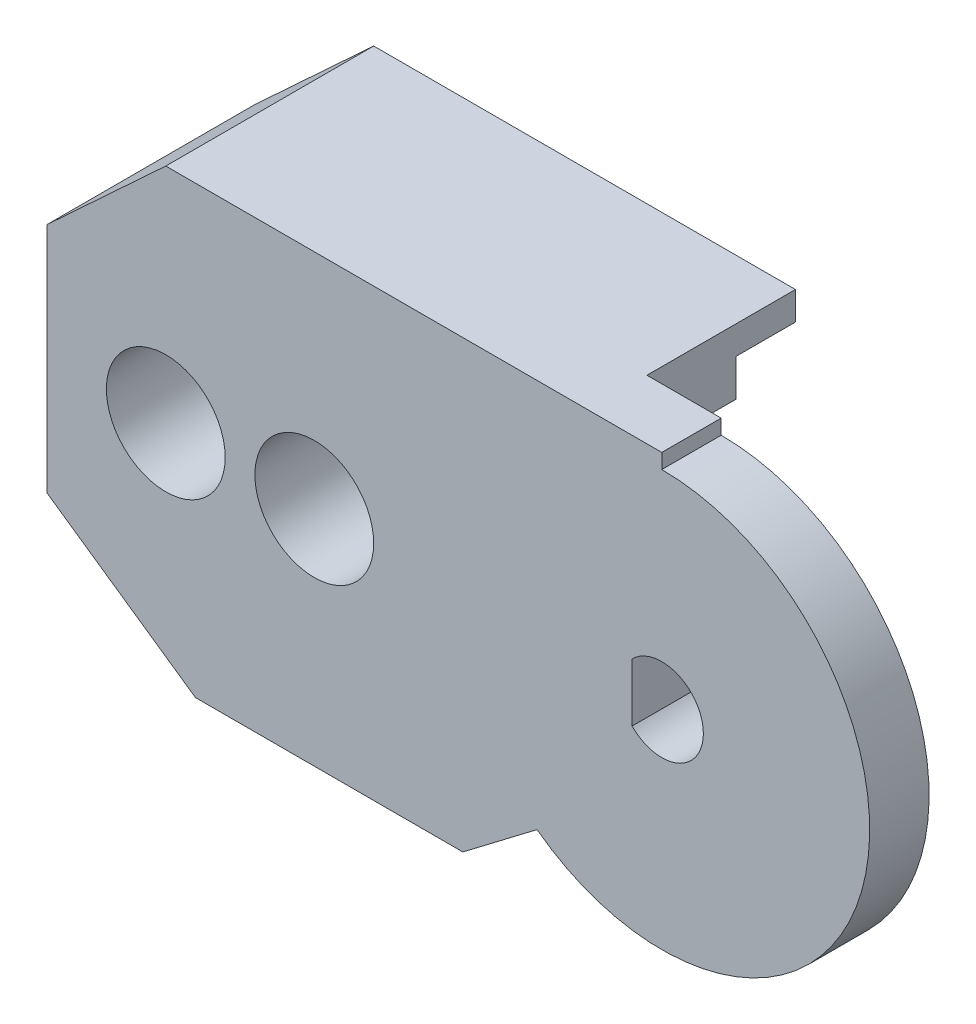
ISO-10303-21;
HEADER;
FILE_DESCRIPTION(('STEP AP214'),'2;1');
FILE_NAME('part.step','',(''),(''),'','','');
FILE_SCHEMA(('AUTOMOTIVE_DESIGN { 1 0 10303 214 1 1 1 1 }'));
ENDSEC;
DATA;
#1=APPLICATION_CONTEXT('core data for automotive mechanical design processes');
#2=APPLICATION_PROTOCOL_DEFINITION('international standard','automotive_design',2000,#1);
#3=PRODUCT_CONTEXT('',#1,'mechanical');
#4=PRODUCT('Part','Part','',(#3));
#5=PRODUCT_RELATED_PRODUCT_CATEGORY('part','',(#4));
#6=PRODUCT_DEFINITION_FORMATION('','',#4);
#7=PRODUCT_DEFINITION_CONTEXT('part definition',#1,'design');
#8=PRODUCT_DEFINITION('design','',#6,#7);
#9=PRODUCT_DEFINITION_SHAPE('','',#8);
#10=(LENGTH_UNIT() NAMED_UNIT(*) SI_UNIT(.MILLI.,.METRE.));
#11=(NAMED_UNIT(*) PLANE_ANGLE_UNIT() SI_UNIT($,.RADIAN.));
#12=(NAMED_UNIT(*) SI_UNIT($,.STERADIAN.) SOLID_ANGLE_UNIT());
#13=UNCERTAINTY_MEASURE_WITH_UNIT(LENGTH_MEASURE(1.E-05),#10,'distance_accuracy_value','');
#14=(GEOMETRIC_REPRESENTATION_CONTEXT(3) GLOBAL_UNCERTAINTY_ASSIGNED_CONTEXT((#13)) GLOBAL_UNIT_ASSIGNED_CONTEXT((#10,
#11,#12)) REPRESENTATION_CONTEXT('',''));
#15=CARTESIAN_POINT('',(0.,0.,0.));
#16=DIRECTION('',(0.,0.,1.));
#17=DIRECTION('',(1.,0.,0.));
#18=AXIS2_PLACEMENT_3D('',#15,#16,#17);
#19=CARTESIAN_POINT('',(-11.7,0.,3.));
#20=DIRECTION('',(0.,0.,-1.));
#21=DIRECTION('',(-1.,0.,0.));
#22=AXIS2_PLACEMENT_3D('',#19,#20,#21);
#23=CYLINDRICAL_SURFACE('',#22,0.949999999999999);
#24=CARTESIAN_POINT('',(-11.7,0.,-5.));
#25=DIRECTION('',(0.,0.,-1.));
#26=DIRECTION('',(-1.,0.,0.));
#27=AXIS2_PLACEMENT_3D('',#24,#25,#26);
#28=CIRCLE('',#27,0.949999999999999);
#29=CARTESIAN_POINT('',(-12.65,0.,-5.));
#30=VERTEX_POINT('',#29);
#31=EDGE_CURVE('E294',#30,#30,#28,.T.);
#32=ORIENTED_EDGE('',*,*,#31,.T.);
#33=EDGE_LOOP('',(#32));
#34=FACE_BOUND('',#33,.T.);
#35=CARTESIAN_POINT('',(-11.7,0.,-1.));
#36=DIRECTION('',(0.,0.,1.));
#37=DIRECTION('',(1.,0.,0.));
#38=AXIS2_PLACEMENT_3D('',#35,#36,#37);
#39=CIRCLE('',#38,0.949999999999999);
#40=CARTESIAN_POINT('',(-10.75,0.,-1.));
#41=VERTEX_POINT('',#40);
#42=EDGE_CURVE('E38',#41,#41,#39,.F.);
#43=ORIENTED_EDGE('',*,*,#42,.F.);
#44=EDGE_LOOP('',(#43));
#45=FACE_BOUND('',#44,.T.);
#46=ADVANCED_FACE('F34',(#34,#45),#23,.F.);
#47=CARTESIAN_POINT('',(-16.7,0.,3.));
#48=DIRECTION('',(0.,0.,-1.));
#49=DIRECTION('',(-1.,0.,0.));
#50=AXIS2_PLACEMENT_3D('',#47,#48,#49);
#51=CYLINDRICAL_SURFACE('',#50,0.950000000000001);
#52=CARTESIAN_POINT('',(-16.7,0.,-5.));
#53=DIRECTION('',(0.,0.,-1.));
#54=DIRECTION('',(-1.,0.,0.));
#55=AXIS2_PLACEMENT_3D('',#52,#53,#54);
#56=CIRCLE('',#55,0.950000000000001);
#57=CARTESIAN_POINT('',(-17.65,0.,-5.));
#58=VERTEX_POINT('',#57);
#59=EDGE_CURVE('E313',#58,#58,#56,.T.);
#60=ORIENTED_EDGE('',*,*,#59,.T.);
#61=EDGE_LOOP('',(#60));
#62=FACE_BOUND('',#61,.T.);
#63=CARTESIAN_POINT('',(-16.7,0.,-1.));
#64=DIRECTION('',(0.,0.,1.));
#65=DIRECTION('',(1.,0.,0.));
#66=AXIS2_PLACEMENT_3D('',#63,#64,#65);
#67=CIRCLE('',#66,0.950000000000001);
#68=CARTESIAN_POINT('',(-15.75,0.,-1.));
#69=VERTEX_POINT('',#68);
#70=EDGE_CURVE('E288',#69,#69,#67,.F.);
#71=ORIENTED_EDGE('',*,*,#70,.F.);
#72=EDGE_LOOP('',(#71));
#73=FACE_BOUND('',#72,.T.);
#74=ADVANCED_FACE('F455',(#62,#73),#51,.F.);
#75=CARTESIAN_POINT('',(0.,0.,-5.));
#76=DIRECTION('',(0.,0.,-1.));
#77=DIRECTION('',(-1.,0.,0.));
#78=AXIS2_PLACEMENT_3D('',#75,#76,#77);
#79=PLANE('',#78);
#80=DIRECTION('',(-0.422651733732796,-0.90629217803789,0.));
#81=VECTOR('',#80,1.);
#82=CARTESIAN_POINT('',(-4.05473958622524,1.89093843848827,-5.));
#83=LINE('',#82,#81);
#84=CARTESIAN_POINT('',(-7.03517048551268,-4.5,-5.));
#85=VERTEX_POINT('',#84);
#86=CARTESIAN_POINT('',(-8.43422835219701,-7.5,-5.));
#87=VERTEX_POINT('',#86);
#88=EDGE_CURVE('E43',#85,#87,#83,.T.);
#89=ORIENTED_EDGE('',*,*,#88,.F.);
#90=DIRECTION('',(1.,0.,0.));
#91=VECTOR('',#90,1.);
#92=CARTESIAN_POINT('',(-7.7,-4.5,-5.));
#93=LINE('',#92,#91);
#94=CARTESIAN_POINT('',(-6.69999999999999,-4.5,-5.));
#95=VERTEX_POINT('',#94);
#96=EDGE_CURVE('E370',#85,#95,#93,.T.);
#97=ORIENTED_EDGE('',*,*,#96,.T.);
#98=DIRECTION('',(0.,-1.,0.));
#99=VECTOR('',#98,1.);
#100=CARTESIAN_POINT('',(-6.69999999999999,-7.5,-5.));
#101=LINE('',#100,#99);
#102=CARTESIAN_POINT('',(-6.69999999999999,-7.5,-5.));
#103=VERTEX_POINT('',#102);
#104=EDGE_CURVE('E372',#95,#103,#101,.T.);
#105=ORIENTED_EDGE('',*,*,#104,.T.);
#106=DIRECTION('',(-1.,0.,0.));
#107=VECTOR('',#106,1.);
#108=CARTESIAN_POINT('',(-15.7,-7.5,-5.));
#109=LINE('',#108,#107);
#110=EDGE_CURVE('E375',#103,#87,#109,.T.);
#111=ORIENTED_EDGE('',*,*,#110,.T.);
#112=EDGE_LOOP('',(#89,#97,#105,#111));
#113=FACE_BOUND('',#112,.T.);
#114=ADVANCED_FACE('F461',(#113),#79,.T.);
#115=CARTESIAN_POINT('',(0.,0.,0.));
#116=DIRECTION('',(0.,0.,1.));
#117=DIRECTION('',(1.,0.,0.));
#118=AXIS2_PLACEMENT_3D('',#115,#116,#117);
#119=PLANE('',#118);
#120=CARTESIAN_POINT('',(0.,0.,0.));
#121=DIRECTION('',(0.,0.,1.));
#122=DIRECTION('',(1.,0.,0.));
#123=AXIS2_PLACEMENT_3D('',#120,#121,#122);
#124=CIRCLE('',#123,3.9);
#125=CARTESIAN_POINT('',(3.9,0.,0.));
#126=VERTEX_POINT('',#125);
#127=EDGE_CURVE('E280',#126,#126,#124,.F.);
#128=ORIENTED_EDGE('',*,*,#127,.F.);
#129=EDGE_LOOP('',(#128));
#130=FACE_BOUND('',#129,.T.);
#131=DIRECTION('',(0.,-1.,0.));
#132=VECTOR('',#131,1.);
#133=CARTESIAN_POINT('',(-6.69999999999999,-7.5,0.));
#134=LINE('',#133,#132);
#135=CARTESIAN_POINT('',(-6.69999999999999,-4.5,0.));
#136=VERTEX_POINT('',#135);
#137=CARTESIAN_POINT('',(-6.69999999999999,-7.5,0.));
#138=VERTEX_POINT('',#137);
#139=EDGE_CURVE('E360',#136,#138,#134,.T.);
#140=ORIENTED_EDGE('',*,*,#139,.F.);
#141=DIRECTION('',(1.,0.,0.));
#142=VECTOR('',#141,1.);
#143=CARTESIAN_POINT('',(-7.7,-4.5,0.));
#144=LINE('',#143,#142);
#145=CARTESIAN_POINT('',(-7.7,-4.5,0.));
#146=VERTEX_POINT('',#145);
#147=EDGE_CURVE('E400',#146,#136,#144,.T.);
#148=ORIENTED_EDGE('',*,*,#147,.F.);
#149=DIRECTION('',(0.,-1.,0.));
#150=VECTOR('',#149,1.);
#151=CARTESIAN_POINT('',(-7.7,2.,0.));
#152=LINE('',#151,#150);
#153=CARTESIAN_POINT('',(-7.7,2.,0.));
#154=VERTEX_POINT('',#153);
#155=EDGE_CURVE('E397',#154,#146,#152,.T.);
#156=ORIENTED_EDGE('',*,*,#155,.F.);
#157=DIRECTION('',(-1.,0.,0.));
#158=VECTOR('',#157,1.);
#159=CARTESIAN_POINT('',(-5.5,2.,0.));
#160=LINE('',#159,#158);
#161=CARTESIAN_POINT('',(-5.5,2.,0.));
#162=VERTEX_POINT('',#161);
#163=EDGE_CURVE('E394',#162,#154,#160,.T.);
#164=ORIENTED_EDGE('',*,*,#163,.F.);
#165=DIRECTION('',(0.,-1.,0.));
#166=VECTOR('',#165,1.);
#167=CARTESIAN_POINT('',(-5.5,5.3,0.));
#168=LINE('',#167,#166);
#169=CARTESIAN_POINT('',(-5.5,5.3,0.));
#170=VERTEX_POINT('',#169);
#171=EDGE_CURVE('E391',#170,#162,#168,.T.);
#172=ORIENTED_EDGE('',*,*,#171,.F.);
#173=DIRECTION('',(-1.,0.,0.));
#174=VECTOR('',#173,1.);
#175=CARTESIAN_POINT('',(-2.5,5.3,0.));
#176=LINE('',#175,#174);
#177=CARTESIAN_POINT('',(-2.5,5.3,0.));
#178=VERTEX_POINT('',#177);
#179=EDGE_CURVE('E389',#178,#170,#176,.T.);
#180=ORIENTED_EDGE('',*,*,#179,.F.);
#181=DIRECTION('',(0.,-1.,0.));
#182=VECTOR('',#181,1.);
#183=CARTESIAN_POINT('',(-2.5,7.5,0.));
#184=LINE('',#183,#182);
#185=CARTESIAN_POINT('',(-2.5,7.5,0.));
#186=VERTEX_POINT('',#185);
#187=EDGE_CURVE('E225',#186,#178,#184,.T.);
#188=ORIENTED_EDGE('',*,*,#187,.F.);
#189=DIRECTION('',(-1.,0.,0.));
#190=VECTOR('',#189,1.);
#191=CARTESIAN_POINT('',(0.,7.5,0.));
#192=LINE('',#191,#190);
#193=CARTESIAN_POINT('',(0.,7.5,0.));
#194=VERTEX_POINT('',#193);
#195=EDGE_CURVE('E255',#194,#186,#192,.T.);
#196=ORIENTED_EDGE('',*,*,#195,.F.);
#197=DIRECTION('',(0.,1.,0.));
#198=VECTOR('',#197,1.);
#199=CARTESIAN_POINT('',(0.,7.,0.));
#200=LINE('',#199,#198);
#201=CARTESIAN_POINT('',(0.,7.,0.));
#202=VERTEX_POINT('',#201);
#203=EDGE_CURVE('E228',#202,#194,#200,.T.);
#204=ORIENTED_EDGE('',*,*,#203,.F.);
#205=CARTESIAN_POINT('',(0.,0.,0.));
#206=DIRECTION('',(0.,0.,1.));
#207=DIRECTION('',(1.,0.,0.));
#208=AXIS2_PLACEMENT_3D('',#205,#206,#207);
#209=CIRCLE('',#208,7.);
#210=CARTESIAN_POINT('',(-4.19999999999999,-5.6,0.));
#211=VERTEX_POINT('',#210);
#212=EDGE_CURVE('E238',#211,#202,#209,.T.);
#213=ORIENTED_EDGE('',*,*,#212,.F.);
#214=DIRECTION('',(0.796162194123103,0.605083267533557,0.));
#215=VECTOR('',#214,1.);
#216=CARTESIAN_POINT('',(-6.69999999999999,-7.5,0.));
#217=LINE('',#216,#215);
#218=EDGE_CURVE('E258',#138,#211,#217,.T.);
#219=ORIENTED_EDGE('',*,*,#218,.F.);
#220=EDGE_LOOP('',(#140,#148,#156,#164,#172,#180,#188,#196,#204,#213,#219));
#221=FACE_BOUND('',#220,.T.);
#222=ADVANCED_FACE('F425',(#130,#221),#119,.F.);
#223=CARTESIAN_POINT('',(0.,7.,2.));
#224=DIRECTION('',(-1.,0.,0.));
#225=DIRECTION('',(0.,0.,1.));
#226=AXIS2_PLACEMENT_3D('',#223,#224,#225);
#227=PLANE('',#226);
#228=ORIENTED_EDGE('',*,*,#203,.T.);
#229=DIRECTION('',(0.,0.,-1.));
#230=VECTOR('',#229,1.);
#231=CARTESIAN_POINT('',(0.,7.5,2.));
#232=LINE('',#231,#230);
#233=CARTESIAN_POINT('',(0.,7.5,2.));
#234=VERTEX_POINT('',#233);
#235=EDGE_CURVE('E274',#234,#194,#232,.T.);
#236=ORIENTED_EDGE('',*,*,#235,.F.);
#237=DIRECTION('',(0.,1.,0.));
#238=VECTOR('',#237,1.);
#239=CARTESIAN_POINT('',(0.,7.,2.));
#240=LINE('',#239,#238);
#241=CARTESIAN_POINT('',(0.,7.,2.));
#242=VERTEX_POINT('',#241);
#243=EDGE_CURVE('E237',#242,#234,#240,.T.);
#244=ORIENTED_EDGE('',*,*,#243,.F.);
#245=DIRECTION('',(0.,0.,-1.));
#246=VECTOR('',#245,1.);
#247=CARTESIAN_POINT('',(0.,7.,2.));
#248=LINE('',#247,#246);
#249=EDGE_CURVE('E277',#242,#202,#248,.T.);
#250=ORIENTED_EDGE('',*,*,#249,.T.);
#251=EDGE_LOOP('',(#228,#236,#244,#250));
#252=FACE_BOUND('',#251,.T.);
#253=ADVANCED_FACE('F36',(#252),#227,.F.);
#254=CARTESIAN_POINT('',(0.,7.5,2.));
#255=DIRECTION('',(0.,-1.,0.));
#256=DIRECTION('',(0.,0.,-1.));
#257=AXIS2_PLACEMENT_3D('',#254,#255,#256);
#258=PLANE('',#257);
#259=ORIENTED_EDGE('',*,*,#195,.T.);
#260=DIRECTION('',(0.,0.,1.));
#261=VECTOR('',#260,1.);
#262=CARTESIAN_POINT('',(-2.5,7.5,-5.));
#263=LINE('',#262,#261);
#264=CARTESIAN_POINT('',(-2.5,7.5,-5.));
#265=VERTEX_POINT('',#264);
#266=EDGE_CURVE('E226',#265,#186,#263,.T.);
#267=ORIENTED_EDGE('',*,*,#266,.F.);
#268=DIRECTION('',(1.,0.,0.));
#269=VECTOR('',#268,1.);
#270=CARTESIAN_POINT('',(-16.7,7.5,-5.));
#271=LINE('',#270,#269);
#272=CARTESIAN_POINT('',(-16.7,7.5,-5.));
#273=VERTEX_POINT('',#272);
#274=EDGE_CURVE('E356',#273,#265,#271,.T.);
#275=ORIENTED_EDGE('',*,*,#274,.F.);
#276=DIRECTION('',(0.,0.,-1.));
#277=VECTOR('',#276,1.);
#278=CARTESIAN_POINT('',(-16.7,7.5,2.));
#279=LINE('',#278,#277);
#280=CARTESIAN_POINT('',(-16.7,7.5,2.));
#281=VERTEX_POINT('',#280);
#282=EDGE_CURVE('E272',#281,#273,#279,.T.);
#283=ORIENTED_EDGE('',*,*,#282,.F.);
#284=DIRECTION('',(-1.,0.,0.));
#285=VECTOR('',#284,1.);
#286=CARTESIAN_POINT('',(0.,7.5,2.));
#287=LINE('',#286,#285);
#288=EDGE_CURVE('E240',#234,#281,#287,.T.);
#289=ORIENTED_EDGE('',*,*,#288,.F.);
#290=ORIENTED_EDGE('',*,*,#235,.T.);
#291=EDGE_LOOP('',(#259,#267,#275,#283,#289,#290));
#292=FACE_BOUND('',#291,.T.);
#293=ADVANCED_FACE('F546',(#292),#258,.F.);
#294=CARTESIAN_POINT('',(-20.7,3.79344266559656,2.));
#295=DIRECTION('',(0.679689720184301,-0.733499750699198,0.));
#296=DIRECTION('',(0.733499750699198,0.679689720184301,0.));
#297=AXIS2_PLACEMENT_3D('',#294,#295,#296);
#298=PLANE('',#297);
#299=ORIENTED_EDGE('',*,*,#282,.T.);
#300=DIRECTION('',(0.733499750699198,0.679689720184301,0.));
#301=VECTOR('',#300,1.);
#302=CARTESIAN_POINT('',(-16.7,7.5,-5.));
#303=LINE('',#302,#301);
#304=CARTESIAN_POINT('',(-20.7,3.79344266559656,-5.));
#305=VERTEX_POINT('',#304);
#306=EDGE_CURVE('E384',#305,#273,#303,.T.);
#307=ORIENTED_EDGE('',*,*,#306,.F.);
#308=DIRECTION('',(0.,0.,-1.));
#309=VECTOR('',#308,1.);
#310=CARTESIAN_POINT('',(-20.7,3.79344266559656,2.));
#311=LINE('',#310,#309);
#312=CARTESIAN_POINT('',(-20.7,3.79344266559656,2.));
#313=VERTEX_POINT('',#312);
#314=EDGE_CURVE('E270',#313,#305,#311,.T.);
#315=ORIENTED_EDGE('',*,*,#314,.F.);
#316=DIRECTION('',(-0.733499750699198,-0.679689720184301,0.));
#317=VECTOR('',#316,1.);
#318=CARTESIAN_POINT('',(-20.7,3.79344266559656,2.));
#319=LINE('',#318,#317);
#320=EDGE_CURVE('E242',#281,#313,#319,.T.);
#321=ORIENTED_EDGE('',*,*,#320,.F.);
#322=EDGE_LOOP('',(#299,#307,#315,#321));
#323=FACE_BOUND('',#322,.T.);
#324=ADVANCED_FACE('F543',(#323),#298,.F.);
#325=CARTESIAN_POINT('',(-20.7,3.79344266559656,2.));
#326=DIRECTION('',(1.,0.,0.));
#327=DIRECTION('',(0.,1.,0.));
#328=AXIS2_PLACEMENT_3D('',#325,#326,#327);
#329=PLANE('',#328);
#330=ORIENTED_EDGE('',*,*,#314,.T.);
#331=DIRECTION('',(0.,1.,0.));
#332=VECTOR('',#331,1.);
#333=CARTESIAN_POINT('',(-20.7,3.79344266559656,-5.));
#334=LINE('',#333,#332);
#335=CARTESIAN_POINT('',(-20.7,-4.03164877833717,-5.));
#336=VERTEX_POINT('',#335);
#337=EDGE_CURVE('E381',#336,#305,#334,.T.);
#338=ORIENTED_EDGE('',*,*,#337,.F.);
#339=DIRECTION('',(0.,0.,-1.));
#340=VECTOR('',#339,1.);
#341=CARTESIAN_POINT('',(-20.7,-4.03164877833717,2.));
#342=LINE('',#341,#340);
#343=CARTESIAN_POINT('',(-20.7,-4.03164877833717,2.));
#344=VERTEX_POINT('',#343);
#345=EDGE_CURVE('E268',#344,#336,#342,.T.);
#346=ORIENTED_EDGE('',*,*,#345,.F.);
#347=DIRECTION('',(0.,-1.,0.));
#348=VECTOR('',#347,1.);
#349=CARTESIAN_POINT('',(-20.7,3.79344266559656,2.));
#350=LINE('',#349,#348);
#351=EDGE_CURVE('E244',#313,#344,#350,.T.);
#352=ORIENTED_EDGE('',*,*,#351,.F.);
#353=EDGE_LOOP('',(#330,#338,#346,#352));
#354=FACE_BOUND('',#353,.T.);
#355=ADVANCED_FACE('F539',(#354),#329,.F.);
#356=CARTESIAN_POINT('',(-20.7,-4.03164877833717,2.));
#357=DIRECTION('',(0.569966563784045,0.821667886781642,0.));
#358=DIRECTION('',(-0.821667886781642,0.569966563784045,0.));
#359=AXIS2_PLACEMENT_3D('',#356,#357,#358);
#360=PLANE('',#359);
#361=ORIENTED_EDGE('',*,*,#345,.T.);
#362=DIRECTION('',(-0.821667886781642,0.569966563784045,0.));
#363=VECTOR('',#362,1.);
#364=CARTESIAN_POINT('',(-20.7,-4.03164877833717,-5.));
#365=LINE('',#364,#363);
#366=CARTESIAN_POINT('',(-15.7,-7.5,-5.));
#367=VERTEX_POINT('',#366);
#368=EDGE_CURVE('E378',#367,#336,#365,.T.);
#369=ORIENTED_EDGE('',*,*,#368,.F.);
#370=DIRECTION('',(0.,0.,-1.));
#371=VECTOR('',#370,1.);
#372=CARTESIAN_POINT('',(-15.7,-7.5,2.));
#373=LINE('',#372,#371);
#374=CARTESIAN_POINT('',(-15.7,-7.5,2.));
#375=VERTEX_POINT('',#374);
#376=EDGE_CURVE('E265',#375,#367,#373,.T.);
#377=ORIENTED_EDGE('',*,*,#376,.F.);
#378=DIRECTION('',(0.821667886781642,-0.569966563784045,0.));
#379=VECTOR('',#378,1.);
#380=CARTESIAN_POINT('',(-20.7,-4.03164877833717,2.));
#381=LINE('',#380,#379);
#382=EDGE_CURVE('E246',#344,#375,#381,.T.);
#383=ORIENTED_EDGE('',*,*,#382,.F.);
#384=EDGE_LOOP('',(#361,#369,#377,#383));
#385=FACE_BOUND('',#384,.T.);
#386=ADVANCED_FACE('F535',(#385),#360,.F.);
#387=CARTESIAN_POINT('',(-15.7,-7.5,2.));
#388=DIRECTION('',(0.,1.,0.));
#389=DIRECTION('',(-1.,0.,0.));
#390=AXIS2_PLACEMENT_3D('',#387,#388,#389);
#391=PLANE('',#390);
#392=CARTESIAN_POINT('',(-9.93422835219701,-7.5,-5.));
#393=VERTEX_POINT('',#392);
#394=EDGE_CURVE('E374',#393,#367,#109,.T.);
#395=ORIENTED_EDGE('',*,*,#394,.F.);
#396=DIRECTION('',(0.,0.,-1.));
#397=VECTOR('',#396,1.);
#398=CARTESIAN_POINT('',(-9.93422835219701,-7.5,-5.75));
#399=LINE('',#398,#397);
#400=CARTESIAN_POINT('',(-9.93422835219701,-7.5,-4.25));
#401=VERTEX_POINT('',#400);
#402=EDGE_CURVE('E316',#401,#393,#399,.T.);
#403=ORIENTED_EDGE('',*,*,#402,.F.);
#404=DIRECTION('',(-1.,0.,0.));
#405=VECTOR('',#404,1.);
#406=CARTESIAN_POINT('',(-8.43422835219701,-7.5,-4.25));
#407=LINE('',#406,#405);
#408=CARTESIAN_POINT('',(-8.43422835219701,-7.5,-4.25));
#409=VERTEX_POINT('',#408);
#410=EDGE_CURVE('E321',#409,#401,#407,.T.);
#411=ORIENTED_EDGE('',*,*,#410,.F.);
#412=DIRECTION('',(0.,0.,1.));
#413=VECTOR('',#412,1.);
#414=CARTESIAN_POINT('',(-8.43422835219701,-7.5,-5.75));
#415=LINE('',#414,#413);
#416=EDGE_CURVE('E325',#87,#409,#415,.T.);
#417=ORIENTED_EDGE('',*,*,#416,.F.);
#418=ORIENTED_EDGE('',*,*,#110,.F.);
#419=DIRECTION('',(0.,0.,1.));
#420=VECTOR('',#419,1.);
#421=CARTESIAN_POINT('',(-6.69999999999999,-7.5,-5.));
#422=LINE('',#421,#420);
#423=EDGE_CURVE('E387',#103,#138,#422,.T.);
#424=ORIENTED_EDGE('',*,*,#423,.T.);
#425=DIRECTION('',(0.,0.,-1.));
#426=VECTOR('',#425,1.);
#427=CARTESIAN_POINT('',(-6.69999999999999,-7.5,2.));
#428=LINE('',#427,#426);
#429=CARTESIAN_POINT('',(-6.69999999999999,-7.5,2.));
#430=VERTEX_POINT('',#429);
#431=EDGE_CURVE('E263',#430,#138,#428,.T.);
#432=ORIENTED_EDGE('',*,*,#431,.F.);
#433=DIRECTION('',(1.,0.,0.));
#434=VECTOR('',#433,1.);
#435=CARTESIAN_POINT('',(-15.7,-7.5,2.));
#436=LINE('',#435,#434);
#437=EDGE_CURVE('E248',#375,#430,#436,.T.);
#438=ORIENTED_EDGE('',*,*,#437,.F.);
#439=ORIENTED_EDGE('',*,*,#376,.T.);
#440=EDGE_LOOP('',(#395,#403,#411,#417,#418,#424,#432,#438,#439));
#441=FACE_BOUND('',#440,.T.);
#442=ADVANCED_FACE('F531',(#441),#391,.F.);
#443=CARTESIAN_POINT('',(-6.69999999999999,-7.5,2.));
#444=DIRECTION('',(-0.605083267533557,0.796162194123103,0.));
#445=DIRECTION('',(-0.796162194123103,-0.605083267533557,0.));
#446=AXIS2_PLACEMENT_3D('',#443,#444,#445);
#447=PLANE('',#446);
#448=ORIENTED_EDGE('',*,*,#218,.T.);
#449=DIRECTION('',(0.,0.,-1.));
#450=VECTOR('',#449,1.);
#451=CARTESIAN_POINT('',(-4.19999999999999,-5.6,2.));
#452=LINE('',#451,#450);
#453=CARTESIAN_POINT('',(-4.19999999999999,-5.6,2.));
#454=VERTEX_POINT('',#453);
#455=EDGE_CURVE('E253',#454,#211,#452,.T.);
#456=ORIENTED_EDGE('',*,*,#455,.F.);
#457=DIRECTION('',(0.796162194123103,0.605083267533557,0.));
#458=VECTOR('',#457,1.);
#459=CARTESIAN_POINT('',(-6.69999999999999,-7.5,2.));
#460=LINE('',#459,#458);
#461=EDGE_CURVE('E250',#430,#454,#460,.T.);
#462=ORIENTED_EDGE('',*,*,#461,.F.);
#463=ORIENTED_EDGE('',*,*,#431,.T.);
#464=EDGE_LOOP('',(#448,#456,#462,#463));
#465=FACE_BOUND('',#464,.T.);
#466=ADVANCED_FACE('F527',(#465),#447,.F.);
#467=CARTESIAN_POINT('',(0.,0.,2.));
#468=DIRECTION('',(0.,0.,-1.));
#469=DIRECTION('',(-1.,0.,0.));
#470=AXIS2_PLACEMENT_3D('',#467,#468,#469);
#471=CYLINDRICAL_SURFACE('',#470,7.);
#472=ORIENTED_EDGE('',*,*,#212,.T.);
#473=ORIENTED_EDGE('',*,*,#249,.F.);
#474=CARTESIAN_POINT('',(0.,0.,2.));
#475=DIRECTION('',(0.,0.,1.));
#476=DIRECTION('',(1.,0.,0.));
#477=AXIS2_PLACEMENT_3D('',#474,#475,#476);
#478=CIRCLE('',#477,7.);
#479=EDGE_CURVE('E234',#454,#242,#478,.T.);
#480=ORIENTED_EDGE('',*,*,#479,.F.);
#481=ORIENTED_EDGE('',*,*,#455,.T.);
#482=EDGE_LOOP('',(#472,#473,#480,#481));
#483=FACE_BOUND('',#482,.T.);
#484=ADVANCED_FACE('F520',(#483),#471,.T.);
#485=CARTESIAN_POINT('',(0.,0.,2.));
#486=DIRECTION('',(0.,0.,1.));
#487=DIRECTION('',(1.,0.,0.));
#488=AXIS2_PLACEMENT_3D('',#485,#486,#487);
#489=PLANE('',#488);
#490=CARTESIAN_POINT('',(-16.7,0.,2.));
#491=DIRECTION('',(0.,0.,1.));
#492=DIRECTION('',(1.,0.,0.));
#493=AXIS2_PLACEMENT_3D('',#490,#491,#492);
#494=CIRCLE('',#493,2.);
#495=CARTESIAN_POINT('',(-14.7,0.,2.));
#496=VERTEX_POINT('',#495);
#497=EDGE_CURVE('E296',#496,#496,#494,.T.);
#498=ORIENTED_EDGE('',*,*,#497,.F.);
#499=EDGE_LOOP('',(#498));
#500=FACE_BOUND('',#499,.T.);
#501=CARTESIAN_POINT('',(-11.7,0.,2.));
#502=DIRECTION('',(0.,0.,1.));
#503=DIRECTION('',(1.,0.,0.));
#504=AXIS2_PLACEMENT_3D('',#501,#502,#503);
#505=CIRCLE('',#504,2.);
#506=CARTESIAN_POINT('',(-9.69999999999999,0.,2.));
#507=VERTEX_POINT('',#506);
#508=EDGE_CURVE('E309',#507,#507,#505,.T.);
#509=ORIENTED_EDGE('',*,*,#508,.F.);
#510=EDGE_LOOP('',(#509));
#511=FACE_BOUND('',#510,.T.);
#512=CARTESIAN_POINT('',(0.,0.,2.));
#513=DIRECTION('',(0.,0.,1.));
#514=DIRECTION('',(1.,0.,0.));
#515=AXIS2_PLACEMENT_3D('',#512,#513,#514);
#516=CIRCLE('',#515,1.4);
#517=CARTESIAN_POINT('',(-1.,-0.979795897113271,2.));
#518=VERTEX_POINT('',#517);
#519=CARTESIAN_POINT('',(-1.,0.979795897113271,2.));
#520=VERTEX_POINT('',#519);
#521=EDGE_CURVE('E351',#518,#520,#516,.T.);
#522=ORIENTED_EDGE('',*,*,#521,.F.);
#523=DIRECTION('',(0.,-1.,0.));
#524=VECTOR('',#523,1.);
#525=CARTESIAN_POINT('',(-1.,0.,2.));
#526=LINE('',#525,#524);
#527=EDGE_CURVE('E347',#520,#518,#526,.T.);
#528=ORIENTED_EDGE('',*,*,#527,.F.);
#529=EDGE_LOOP('',(#522,#528));
#530=FACE_BOUND('',#529,.T.);
#531=ORIENTED_EDGE('',*,*,#479,.T.);
#532=ORIENTED_EDGE('',*,*,#243,.T.);
#533=ORIENTED_EDGE('',*,*,#288,.T.);
#534=ORIENTED_EDGE('',*,*,#320,.T.);
#535=ORIENTED_EDGE('',*,*,#351,.T.);
#536=ORIENTED_EDGE('',*,*,#382,.T.);
#537=ORIENTED_EDGE('',*,*,#437,.T.);
#538=ORIENTED_EDGE('',*,*,#461,.T.);
#539=EDGE_LOOP('',(#531,#532,#533,#534,#535,#536,#537,#538));
#540=FACE_BOUND('',#539,.T.);
#541=ADVANCED_FACE('F517',(#500,#511,#530,#540),#489,.T.);
#542=CARTESIAN_POINT('',(-2.5,7.5,-5.));
#543=DIRECTION('',(-1.,0.,0.));
#544=DIRECTION('',(0.,-1.,0.));
#545=AXIS2_PLACEMENT_3D('',#542,#543,#544);
#546=PLANE('',#545);
#547=DIRECTION('',(0.,-1.,0.));
#548=VECTOR('',#547,1.);
#549=CARTESIAN_POINT('',(-2.5,5.3,-3.));
#550=LINE('',#549,#548);
#551=CARTESIAN_POINT('',(-2.5,6.55,-3.));
#552=VERTEX_POINT('',#551);
#553=CARTESIAN_POINT('',(-2.5,5.3,-3.));
#554=VERTEX_POINT('',#553);
#555=EDGE_CURVE('E201',#552,#554,#550,.T.);
#556=ORIENTED_EDGE('',*,*,#555,.F.);
#557=DIRECTION('',(0.,0.,-1.));
#558=VECTOR('',#557,1.);
#559=CARTESIAN_POINT('',(-2.5,6.55,-3.));
#560=LINE('',#559,#558);
#561=CARTESIAN_POINT('',(-2.5,6.55,-5.));
#562=VERTEX_POINT('',#561);
#563=EDGE_CURVE('E312',#552,#562,#560,.T.);
#564=ORIENTED_EDGE('',*,*,#563,.T.);
#565=DIRECTION('',(0.,-1.,0.));
#566=VECTOR('',#565,1.);
#567=CARTESIAN_POINT('',(-2.5,7.5,-5.));
#568=LINE('',#567,#566);
#569=EDGE_CURVE('E359',#265,#562,#568,.T.);
#570=ORIENTED_EDGE('',*,*,#569,.F.);
#571=ORIENTED_EDGE('',*,*,#266,.T.);
#572=ORIENTED_EDGE('',*,*,#187,.T.);
#573=DIRECTION('',(0.,0.,1.));
#574=VECTOR('',#573,1.);
#575=CARTESIAN_POINT('',(-2.5,5.3,-5.));
#576=LINE('',#575,#574);
#577=EDGE_CURVE('E217',#554,#178,#576,.T.);
#578=ORIENTED_EDGE('',*,*,#577,.F.);
#579=EDGE_LOOP('',(#556,#564,#570,#571,#572,#578));
#580=FACE_BOUND('',#579,.T.);
#581=ADVANCED_FACE('F223',(#580),#546,.F.);
#582=CARTESIAN_POINT('',(-2.5,5.3,-5.));
#583=DIRECTION('',(0.,1.,0.));
#584=DIRECTION('',(0.,0.,1.));
#585=AXIS2_PLACEMENT_3D('',#582,#583,#584);
#586=PLANE('',#585);
#587=DIRECTION('',(0.,0.,1.));
#588=VECTOR('',#587,1.);
#589=CARTESIAN_POINT('',(-5.5,5.3,-5.));
#590=LINE('',#589,#588);
#591=CARTESIAN_POINT('',(-5.5,5.3,-3.));
#592=VERTEX_POINT('',#591);
#593=EDGE_CURVE('E219',#592,#170,#590,.T.);
#594=ORIENTED_EDGE('',*,*,#593,.F.);
#595=DIRECTION('',(-1.,0.,0.));
#596=VECTOR('',#595,1.);
#597=CARTESIAN_POINT('',(-2.5,5.3,-3.));
#598=LINE('',#597,#596);
#599=EDGE_CURVE('E205',#554,#592,#598,.T.);
#600=ORIENTED_EDGE('',*,*,#599,.F.);
#601=ORIENTED_EDGE('',*,*,#577,.T.);
#602=ORIENTED_EDGE('',*,*,#179,.T.);
#603=EDGE_LOOP('',(#594,#600,#601,#602));
#604=FACE_BOUND('',#603,.T.);
#605=ADVANCED_FACE('F215',(#604),#586,.F.);
#606=CARTESIAN_POINT('',(-5.5,5.3,-5.));
#607=DIRECTION('',(-1.,0.,0.));
#608=DIRECTION('',(0.,0.,1.));
#609=AXIS2_PLACEMENT_3D('',#606,#607,#608);
#610=PLANE('',#609);
#611=ORIENTED_EDGE('',*,*,#171,.T.);
#612=DIRECTION('',(0.,0.,1.));
#613=VECTOR('',#612,1.);
#614=CARTESIAN_POINT('',(-5.5,2.,-5.));
#615=LINE('',#614,#613);
#616=CARTESIAN_POINT('',(-5.5,2.,-5.));
#617=VERTEX_POINT('',#616);
#618=EDGE_CURVE('E230',#617,#162,#615,.T.);
#619=ORIENTED_EDGE('',*,*,#618,.F.);
#620=DIRECTION('',(0.,-1.,0.));
#621=VECTOR('',#620,1.);
#622=CARTESIAN_POINT('',(-5.5,5.3,-5.));
#623=LINE('',#622,#621);
#624=CARTESIAN_POINT('',(-5.5,6.55,-5.));
#625=VERTEX_POINT('',#624);
#626=EDGE_CURVE('E363',#625,#617,#623,.T.);
#627=ORIENTED_EDGE('',*,*,#626,.F.);
#628=DIRECTION('',(0.,0.,-1.));
#629=VECTOR('',#628,1.);
#630=CARTESIAN_POINT('',(-5.5,6.55,-3.));
#631=LINE('',#630,#629);
#632=CARTESIAN_POINT('',(-5.5,6.55,-3.));
#633=VERTEX_POINT('',#632);
#634=EDGE_CURVE('E304',#633,#625,#631,.T.);
#635=ORIENTED_EDGE('',*,*,#634,.F.);
#636=DIRECTION('',(0.,1.,0.));
#637=VECTOR('',#636,1.);
#638=CARTESIAN_POINT('',(-5.5,5.3,-3.));
#639=LINE('',#638,#637);
#640=EDGE_CURVE('E220',#592,#633,#639,.T.);
#641=ORIENTED_EDGE('',*,*,#640,.F.);
#642=ORIENTED_EDGE('',*,*,#593,.T.);
#643=EDGE_LOOP('',(#611,#619,#627,#635,#641,#642));
#644=FACE_BOUND('',#643,.T.);
#645=ADVANCED_FACE('F421',(#644),#610,.F.);
#646=CARTESIAN_POINT('',(-5.5,2.,-5.));
#647=DIRECTION('',(0.,1.,0.));
#648=DIRECTION('',(0.,0.,1.));
#649=AXIS2_PLACEMENT_3D('',#646,#647,#648);
#650=PLANE('',#649);
#651=ORIENTED_EDGE('',*,*,#163,.T.);
#652=DIRECTION('',(0.,0.,1.));
#653=VECTOR('',#652,1.);
#654=CARTESIAN_POINT('',(-7.7,2.,-5.));
#655=LINE('',#654,#653);
#656=CARTESIAN_POINT('',(-7.7,2.,-5.));
#657=VERTEX_POINT('',#656);
#658=EDGE_CURVE('E412',#657,#154,#655,.T.);
#659=ORIENTED_EDGE('',*,*,#658,.F.);
#660=DIRECTION('',(-1.,0.,0.));
#661=VECTOR('',#660,1.);
#662=CARTESIAN_POINT('',(-5.5,2.,-5.));
#663=LINE('',#662,#661);
#664=EDGE_CURVE('E365',#617,#657,#663,.T.);
#665=ORIENTED_EDGE('',*,*,#664,.F.);
#666=ORIENTED_EDGE('',*,*,#618,.T.);
#667=EDGE_LOOP('',(#651,#659,#665,#666));
#668=FACE_BOUND('',#667,.T.);
#669=ADVANCED_FACE('F418',(#668),#650,.F.);
#670=CARTESIAN_POINT('',(-7.7,2.,-5.));
#671=DIRECTION('',(-1.,0.,0.));
#672=DIRECTION('',(0.,-1.,0.));
#673=AXIS2_PLACEMENT_3D('',#670,#671,#672);
#674=PLANE('',#673);
#675=DIRECTION('',(0.,0.,1.));
#676=VECTOR('',#675,1.);
#677=CARTESIAN_POINT('',(-7.7,-4.5,-5.));
#678=LINE('',#677,#676);
#679=CARTESIAN_POINT('',(-7.7,-4.5,-4.25));
#680=VERTEX_POINT('',#679);
#681=EDGE_CURVE('E410',#680,#146,#678,.T.);
#682=ORIENTED_EDGE('',*,*,#681,.F.);
#683=DIRECTION('',(0.,1.,0.));
#684=VECTOR('',#683,1.);
#685=CARTESIAN_POINT('',(-7.7,2.,-4.25));
#686=LINE('',#685,#684);
#687=CARTESIAN_POINT('',(-7.7,-2.96853910981055,-4.25));
#688=VERTEX_POINT('',#687);
#689=EDGE_CURVE('E338',#680,#688,#686,.T.);
#690=ORIENTED_EDGE('',*,*,#689,.T.);
#691=DIRECTION('',(0.,0.,1.));
#692=VECTOR('',#691,1.);
#693=CARTESIAN_POINT('',(-7.7,-2.96853910981055,-5.));
#694=LINE('',#693,#692);
#695=CARTESIAN_POINT('',(-7.7,-2.96853910981055,-5.));
#696=VERTEX_POINT('',#695);
#697=EDGE_CURVE('E332',#696,#688,#694,.T.);
#698=ORIENTED_EDGE('',*,*,#697,.F.);
#699=DIRECTION('',(0.,-1.,0.));
#700=VECTOR('',#699,1.);
#701=CARTESIAN_POINT('',(-7.7,2.,-5.));
#702=LINE('',#701,#700);
#703=EDGE_CURVE('E367',#657,#696,#702,.T.);
#704=ORIENTED_EDGE('',*,*,#703,.F.);
#705=ORIENTED_EDGE('',*,*,#658,.T.);
#706=ORIENTED_EDGE('',*,*,#155,.T.);
#707=EDGE_LOOP('',(#682,#690,#698,#704,#705,#706));
#708=FACE_BOUND('',#707,.T.);
#709=ADVANCED_FACE('F429',(#708),#674,.F.);
#710=CARTESIAN_POINT('',(-7.7,-4.5,-5.));
#711=DIRECTION('',(0.,-1.,0.));
#712=DIRECTION('',(0.,0.,-1.));
#713=AXIS2_PLACEMENT_3D('',#710,#711,#712);
#714=PLANE('',#713);
#715=DIRECTION('',(0.,0.,1.));
#716=VECTOR('',#715,1.);
#717=CARTESIAN_POINT('',(-7.03517048551267,-4.5,-5.));
#718=LINE('',#717,#716);
#719=CARTESIAN_POINT('',(-7.03517048551267,-4.5,-4.25));
#720=VERTEX_POINT('',#719);
#721=EDGE_CURVE('E335',#85,#720,#718,.T.);
#722=ORIENTED_EDGE('',*,*,#721,.T.);
#723=DIRECTION('',(-1.,0.,0.));
#724=VECTOR('',#723,1.);
#725=CARTESIAN_POINT('',(-7.7,-4.5,-4.25));
#726=LINE('',#725,#724);
#727=EDGE_CURVE('E11',#720,#680,#726,.T.);
#728=ORIENTED_EDGE('',*,*,#727,.T.);
#729=ORIENTED_EDGE('',*,*,#681,.T.);
#730=ORIENTED_EDGE('',*,*,#147,.T.);
#731=DIRECTION('',(0.,0.,1.));
#732=VECTOR('',#731,1.);
#733=CARTESIAN_POINT('',(-6.69999999999999,-4.5,-5.));
#734=LINE('',#733,#732);
#735=EDGE_CURVE('E407',#95,#136,#734,.T.);
#736=ORIENTED_EDGE('',*,*,#735,.F.);
#737=ORIENTED_EDGE('',*,*,#96,.F.);
#738=EDGE_LOOP('',(#722,#728,#729,#730,#736,#737));
#739=FACE_BOUND('',#738,.T.);
#740=ADVANCED_FACE('F502',(#739),#714,.F.);
#741=CARTESIAN_POINT('',(-6.69999999999999,-7.5,-5.));
#742=DIRECTION('',(-1.,0.,0.));
#743=DIRECTION('',(0.,0.,1.));
#744=AXIS2_PLACEMENT_3D('',#741,#742,#743);
#745=PLANE('',#744);
#746=ORIENTED_EDGE('',*,*,#139,.T.);
#747=ORIENTED_EDGE('',*,*,#423,.F.);
#748=ORIENTED_EDGE('',*,*,#104,.F.);
#749=ORIENTED_EDGE('',*,*,#735,.T.);
#750=EDGE_LOOP('',(#746,#747,#748,#749));
#751=FACE_BOUND('',#750,.T.);
#752=ADVANCED_FACE('F499',(#751),#745,.F.);
#753=DIRECTION('',(1.,0.,0.));
#754=VECTOR('',#753,1.);
#755=CARTESIAN_POINT('',(-2.5,6.55,-5.));
#756=LINE('',#755,#754);
#757=EDGE_CURVE('E212',#625,#562,#756,.T.);
#758=ORIENTED_EDGE('',*,*,#757,.F.);
#759=ORIENTED_EDGE('',*,*,#626,.T.);
#760=ORIENTED_EDGE('',*,*,#664,.T.);
#761=ORIENTED_EDGE('',*,*,#703,.T.);
#762=DIRECTION('',(-1.,0.,0.));
#763=VECTOR('',#762,1.);
#764=CARTESIAN_POINT('',(0.,-2.96853910981055,-5.));
#765=LINE('',#764,#763);
#766=CARTESIAN_POINT('',(-7.82096968353303,-2.96853910981055,-5.));
#767=VERTEX_POINT('',#766);
#768=EDGE_CURVE('E283',#696,#767,#765,.T.);
#769=ORIENTED_EDGE('',*,*,#768,.T.);
#770=DIRECTION('',(0.422651733732796,0.90629217803789,0.));
#771=VECTOR('',#770,1.);
#772=CARTESIAN_POINT('',(-5.28678785418423,2.46550737896255,-5.));
#773=LINE('',#772,#771);
#774=EDGE_CURVE('E286',#393,#767,#773,.T.);
#775=ORIENTED_EDGE('',*,*,#774,.F.);
#776=ORIENTED_EDGE('',*,*,#394,.T.);
#777=ORIENTED_EDGE('',*,*,#368,.T.);
#778=ORIENTED_EDGE('',*,*,#337,.T.);
#779=ORIENTED_EDGE('',*,*,#306,.T.);
#780=ORIENTED_EDGE('',*,*,#274,.T.);
#781=ORIENTED_EDGE('',*,*,#569,.T.);
#782=EDGE_LOOP('',(#758,#759,#760,#761,#769,#775,#776,#777,#778,#779,#780,#781));
#783=FACE_BOUND('',#782,.T.);
#784=ORIENTED_EDGE('',*,*,#59,.F.);
#785=EDGE_LOOP('',(#784));
#786=FACE_BOUND('',#785,.T.);
#787=ORIENTED_EDGE('',*,*,#31,.F.);
#788=EDGE_LOOP('',(#787));
#789=FACE_BOUND('',#788,.T.);
#790=ADVANCED_FACE('F434',(#783,#786,#789),#79,.T.);
#791=CARTESIAN_POINT('',(0.,0.,-1.2));
#792=DIRECTION('',(0.,0.,1.));
#793=DIRECTION('',(1.,0.,0.));
#794=AXIS2_PLACEMENT_3D('',#791,#792,#793);
#795=CYLINDRICAL_SURFACE('',#794,3.9);
#796=CARTESIAN_POINT('',(0.,0.,-1.2));
#797=DIRECTION('',(0.,0.,-1.));
#798=DIRECTION('',(-1.,0.,0.));
#799=AXIS2_PLACEMENT_3D('',#796,#797,#798);
#800=CIRCLE('',#799,3.9);
#801=CARTESIAN_POINT('',(-3.9,0.,-1.2));
#802=VERTEX_POINT('',#801);
#803=EDGE_CURVE('E353',#802,#802,#800,.T.);
#804=ORIENTED_EDGE('',*,*,#803,.F.);
#805=EDGE_LOOP('',(#804));
#806=FACE_BOUND('',#805,.T.);
#807=ORIENTED_EDGE('',*,*,#127,.T.);
#808=EDGE_LOOP('',(#807));
#809=FACE_BOUND('',#808,.T.);
#810=ADVANCED_FACE('F492',(#806,#809),#795,.T.);
#811=CARTESIAN_POINT('',(0.,0.,-1.2));
#812=DIRECTION('',(0.,0.,-1.));
#813=DIRECTION('',(-1.,0.,0.));
#814=AXIS2_PLACEMENT_3D('',#811,#812,#813);
#815=PLANE('',#814);
#816=CARTESIAN_POINT('',(0.,0.,-1.2));
#817=DIRECTION('',(0.,0.,-1.));
#818=DIRECTION('',(-1.,0.,0.));
#819=AXIS2_PLACEMENT_3D('',#816,#817,#818);
#820=CIRCLE('',#819,1.4);
#821=CARTESIAN_POINT('',(-1.,0.979795897113271,-1.2));
#822=VERTEX_POINT('',#821);
#823=CARTESIAN_POINT('',(-1.,-0.979795897113271,-1.2));
#824=VERTEX_POINT('',#823);
#825=EDGE_CURVE('E341',#822,#824,#820,.T.);
#826=ORIENTED_EDGE('',*,*,#825,.F.);
#827=DIRECTION('',(0.,1.,0.));
#828=VECTOR('',#827,1.);
#829=CARTESIAN_POINT('',(-1.,0.979795897113271,-1.2));
#830=LINE('',#829,#828);
#831=EDGE_CURVE('E343',#824,#822,#830,.T.);
#832=ORIENTED_EDGE('',*,*,#831,.F.);
#833=EDGE_LOOP('',(#826,#832));
#834=FACE_BOUND('',#833,.T.);
#835=ORIENTED_EDGE('',*,*,#803,.T.);
#836=EDGE_LOOP('',(#835));
#837=FACE_BOUND('',#836,.T.);
#838=ADVANCED_FACE('F488',(#834,#837),#815,.T.);
#839=CARTESIAN_POINT('',(0.,0.,3.8));
#840=DIRECTION('',(0.,0.,-1.));
#841=DIRECTION('',(-1.,0.,0.));
#842=AXIS2_PLACEMENT_3D('',#839,#840,#841);
#843=CYLINDRICAL_SURFACE('',#842,1.4);
#844=ORIENTED_EDGE('',*,*,#521,.T.);
#845=DIRECTION('',(0.,0.,-1.));
#846=VECTOR('',#845,1.);
#847=CARTESIAN_POINT('',(-1.,0.979795897113271,3.8));
#848=LINE('',#847,#846);
#849=EDGE_CURVE('E59',#520,#822,#848,.T.);
#850=ORIENTED_EDGE('',*,*,#849,.T.);
#851=ORIENTED_EDGE('',*,*,#825,.T.);
#852=DIRECTION('',(0.,0.,-1.));
#853=VECTOR('',#852,1.);
#854=CARTESIAN_POINT('',(-1.,-0.979795897113271,3.8));
#855=LINE('',#854,#853);
#856=EDGE_CURVE('E345',#518,#824,#855,.T.);
#857=ORIENTED_EDGE('',*,*,#856,.F.);
#858=EDGE_LOOP('',(#844,#850,#851,#857));
#859=FACE_BOUND('',#858,.T.);
#860=ADVANCED_FACE('F485',(#859),#843,.F.);
#861=CARTESIAN_POINT('',(-1.,0.979795897113271,3.8));
#862=DIRECTION('',(-1.,0.,0.));
#863=DIRECTION('',(0.,0.,1.));
#864=AXIS2_PLACEMENT_3D('',#861,#862,#863);
#865=PLANE('',#864);
#866=ORIENTED_EDGE('',*,*,#527,.T.);
#867=ORIENTED_EDGE('',*,*,#856,.T.);
#868=ORIENTED_EDGE('',*,*,#831,.T.);
#869=ORIENTED_EDGE('',*,*,#849,.F.);
#870=EDGE_LOOP('',(#866,#867,#868,#869));
#871=FACE_BOUND('',#870,.T.);
#872=ADVANCED_FACE('F474',(#871),#865,.F.);
#873=CARTESIAN_POINT('',(-6.32096968353303,-2.96853910981055,-4.25));
#874=DIRECTION('',(0.,0.,1.));
#875=DIRECTION('',(1.,0.,0.));
#876=AXIS2_PLACEMENT_3D('',#873,#874,#875);
#877=PLANE('',#876);
#878=ORIENTED_EDGE('',*,*,#727,.F.);
#879=DIRECTION('',(-0.422651733732796,-0.90629217803789,0.));
#880=VECTOR('',#879,1.);
#881=CARTESIAN_POINT('',(-6.32096968353303,-2.96853910981055,-4.25));
#882=LINE('',#881,#880);
#883=EDGE_CURVE('E323',#720,#409,#882,.T.);
#884=ORIENTED_EDGE('',*,*,#883,.T.);
#885=ORIENTED_EDGE('',*,*,#410,.T.);
#886=DIRECTION('',(-0.422651733732796,-0.90629217803789,0.));
#887=VECTOR('',#886,1.);
#888=CARTESIAN_POINT('',(-7.82096968353303,-2.96853910981055,-4.25));
#889=LINE('',#888,#887);
#890=CARTESIAN_POINT('',(-7.82096968353303,-2.96853910981055,-4.25));
#891=VERTEX_POINT('',#890);
#892=EDGE_CURVE('E330',#891,#401,#889,.T.);
#893=ORIENTED_EDGE('',*,*,#892,.F.);
#894=DIRECTION('',(-1.,0.,0.));
#895=VECTOR('',#894,1.);
#896=CARTESIAN_POINT('',(-6.32096968353303,-2.96853910981055,-4.25));
#897=LINE('',#896,#895);
#898=EDGE_CURVE('E320',#688,#891,#897,.T.);
#899=ORIENTED_EDGE('',*,*,#898,.F.);
#900=ORIENTED_EDGE('',*,*,#689,.F.);
#901=EDGE_LOOP('',(#878,#884,#885,#893,#899,#900));
#902=FACE_BOUND('',#901,.T.);
#903=ADVANCED_FACE('F471',(#902),#877,.F.);
#904=CARTESIAN_POINT('',(-6.32096968353303,-2.96853910981055,-5.75));
#905=DIRECTION('',(0.90629217803789,-0.422651733732796,0.));
#906=DIRECTION('',(0.422651733732796,0.90629217803789,0.));
#907=AXIS2_PLACEMENT_3D('',#904,#905,#906);
#908=PLANE('',#907);
#909=ORIENTED_EDGE('',*,*,#88,.T.);
#910=ORIENTED_EDGE('',*,*,#416,.T.);
#911=ORIENTED_EDGE('',*,*,#883,.F.);
#912=ORIENTED_EDGE('',*,*,#721,.F.);
#913=EDGE_LOOP('',(#909,#910,#911,#912));
#914=FACE_BOUND('',#913,.T.);
#915=ADVANCED_FACE('F470',(#914),#908,.F.);
#916=CARTESIAN_POINT('',(2.11325866866398,-2.96853910981055,0.));
#917=DIRECTION('',(0.,-1.,0.));
#918=DIRECTION('',(0.,0.,-1.));
#919=AXIS2_PLACEMENT_3D('',#916,#917,#918);
#920=PLANE('',#919);
#921=ORIENTED_EDGE('',*,*,#697,.T.);
#922=ORIENTED_EDGE('',*,*,#898,.T.);
#923=DIRECTION('',(0.,0.,-1.));
#924=VECTOR('',#923,1.);
#925=CARTESIAN_POINT('',(-7.82096968353303,-2.96853910981055,-5.75));
#926=LINE('',#925,#924);
#927=EDGE_CURVE('E51',#891,#767,#926,.T.);
#928=ORIENTED_EDGE('',*,*,#927,.T.);
#929=ORIENTED_EDGE('',*,*,#768,.F.);
#930=EDGE_LOOP('',(#921,#922,#928,#929));
#931=FACE_BOUND('',#930,.T.);
#932=ADVANCED_FACE('F466',(#931),#920,.T.);
#933=CARTESIAN_POINT('',(-7.82096968353303,-2.96853910981055,-5.75));
#934=DIRECTION('',(-0.90629217803789,0.422651733732796,0.));
#935=DIRECTION('',(-0.422651733732796,-0.90629217803789,0.));
#936=AXIS2_PLACEMENT_3D('',#933,#934,#935);
#937=PLANE('',#936);
#938=ORIENTED_EDGE('',*,*,#774,.T.);
#939=ORIENTED_EDGE('',*,*,#927,.F.);
#940=ORIENTED_EDGE('',*,*,#892,.T.);
#941=ORIENTED_EDGE('',*,*,#402,.T.);
#942=EDGE_LOOP('',(#938,#939,#940,#941));
#943=FACE_BOUND('',#942,.T.);
#944=ADVANCED_FACE('F469',(#943),#937,.F.);
#945=CARTESIAN_POINT('',(-16.7,0.,-1.));
#946=DIRECTION('',(0.,0.,1.));
#947=DIRECTION('',(1.,0.,0.));
#948=AXIS2_PLACEMENT_3D('',#945,#946,#947);
#949=PLANE('',#948);
#950=CARTESIAN_POINT('',(-16.7,0.,-1.));
#951=DIRECTION('',(0.,0.,1.));
#952=DIRECTION('',(1.,0.,0.));
#953=AXIS2_PLACEMENT_3D('',#950,#951,#952);
#954=CIRCLE('',#953,2.);
#955=CARTESIAN_POINT('',(-14.7,0.,-1.));
#956=VERTEX_POINT('',#955);
#957=EDGE_CURVE('E290',#956,#956,#954,.T.);
#958=ORIENTED_EDGE('',*,*,#957,.T.);
#959=EDGE_LOOP('',(#958));
#960=FACE_BOUND('',#959,.T.);
#961=ORIENTED_EDGE('',*,*,#70,.T.);
#962=EDGE_LOOP('',(#961));
#963=FACE_BOUND('',#962,.T.);
#964=ADVANCED_FACE('F481',(#960,#963),#949,.T.);
#965=CARTESIAN_POINT('',(-16.7,0.,-1.));
#966=DIRECTION('',(0.,0.,1.));
#967=DIRECTION('',(1.,0.,0.));
#968=AXIS2_PLACEMENT_3D('',#965,#966,#967);
#969=CYLINDRICAL_SURFACE('',#968,2.);
#970=ORIENTED_EDGE('',*,*,#957,.F.);
#971=EDGE_LOOP('',(#970));
#972=FACE_BOUND('',#971,.T.);
#973=ORIENTED_EDGE('',*,*,#497,.T.);
#974=EDGE_LOOP('',(#973));
#975=FACE_BOUND('',#974,.T.);
#976=ADVANCED_FACE('F710',(#972,#975),#969,.F.);
#977=CARTESIAN_POINT('',(-11.7,0.,-1.));
#978=DIRECTION('',(0.,0.,1.));
#979=DIRECTION('',(1.,0.,0.));
#980=AXIS2_PLACEMENT_3D('',#977,#978,#979);
#981=PLANE('',#980);
#982=CARTESIAN_POINT('',(-11.7,0.,-1.));
#983=DIRECTION('',(0.,0.,1.));
#984=DIRECTION('',(1.,0.,0.));
#985=AXIS2_PLACEMENT_3D('',#982,#983,#984);
#986=CIRCLE('',#985,2.);
#987=CARTESIAN_POINT('',(-9.69999999999999,0.,-1.));
#988=VERTEX_POINT('',#987);
#989=EDGE_CURVE('E301',#988,#988,#986,.T.);
#990=ORIENTED_EDGE('',*,*,#989,.T.);
#991=EDGE_LOOP('',(#990));
#992=FACE_BOUND('',#991,.T.);
#993=ORIENTED_EDGE('',*,*,#42,.T.);
#994=EDGE_LOOP('',(#993));
#995=FACE_BOUND('',#994,.T.);
#996=ADVANCED_FACE('F450',(#992,#995),#981,.T.);
#997=CARTESIAN_POINT('',(-11.7,0.,-1.));
#998=DIRECTION('',(0.,0.,1.));
#999=DIRECTION('',(1.,0.,0.));
#1000=AXIS2_PLACEMENT_3D('',#997,#998,#999);
#1001=CYLINDRICAL_SURFACE('',#1000,2.);
#1002=ORIENTED_EDGE('',*,*,#989,.F.);
#1003=EDGE_LOOP('',(#1002));
#1004=FACE_BOUND('',#1003,.T.);
#1005=ORIENTED_EDGE('',*,*,#508,.T.);
#1006=EDGE_LOOP('',(#1005));
#1007=FACE_BOUND('',#1006,.T.);
#1008=ADVANCED_FACE('F443',(#1004,#1007),#1001,.F.);
#1009=CARTESIAN_POINT('',(-2.5,6.55,-3.));
#1010=DIRECTION('',(0.,1.,0.));
#1011=DIRECTION('',(0.,0.,1.));
#1012=AXIS2_PLACEMENT_3D('',#1009,#1010,#1011);
#1013=PLANE('',#1012);
#1014=ORIENTED_EDGE('',*,*,#757,.T.);
#1015=ORIENTED_EDGE('',*,*,#563,.F.);
#1016=DIRECTION('',(1.,0.,0.));
#1017=VECTOR('',#1016,1.);
#1018=CARTESIAN_POINT('',(-2.5,6.55,-3.));
#1019=LINE('',#1018,#1017);
#1020=EDGE_CURVE('E208',#633,#552,#1019,.T.);
#1021=ORIENTED_EDGE('',*,*,#1020,.F.);
#1022=ORIENTED_EDGE('',*,*,#634,.T.);
#1023=EDGE_LOOP('',(#1014,#1015,#1021,#1022));
#1024=FACE_BOUND('',#1023,.T.);
#1025=ADVANCED_FACE('F441',(#1024),#1013,.F.);
#1026=CARTESIAN_POINT('',(0.,0.,-3.));
#1027=DIRECTION('',(0.,0.,1.));
#1028=DIRECTION('',(1.,0.,0.));
#1029=AXIS2_PLACEMENT_3D('',#1026,#1027,#1028);
#1030=PLANE('',#1029);
#1031=ORIENTED_EDGE('',*,*,#555,.T.);
#1032=ORIENTED_EDGE('',*,*,#599,.T.);
#1033=ORIENTED_EDGE('',*,*,#640,.T.);
#1034=ORIENTED_EDGE('',*,*,#1020,.T.);
#1035=EDGE_LOOP('',(#1031,#1032,#1033,#1034));
#1036=FACE_BOUND('',#1035,.T.);
#1037=ADVANCED_FACE('F203',(#1036),#1030,.F.);
#1038=CLOSED_SHELL('',(#46,#74,#114,#222,#253,#293,#324,#355,#386,#442,#466,#484,#541,#581,#605,
#645,#669,#709,#740,#752,#790,#810,#838,#860,#872,#903,#915,#932,#944,#964,#976,#996,#1008,
#1025,#1037));
#1039=MANIFOLD_SOLID_BREP('B2',#1038);
#1040=ADVANCED_BREP_SHAPE_REPRESENTATION('',(#18,#1039),#14);
#1041=SHAPE_DEFINITION_REPRESENTATION(#9,#1040);
ENDSEC;
END-ISO-10303-21;
